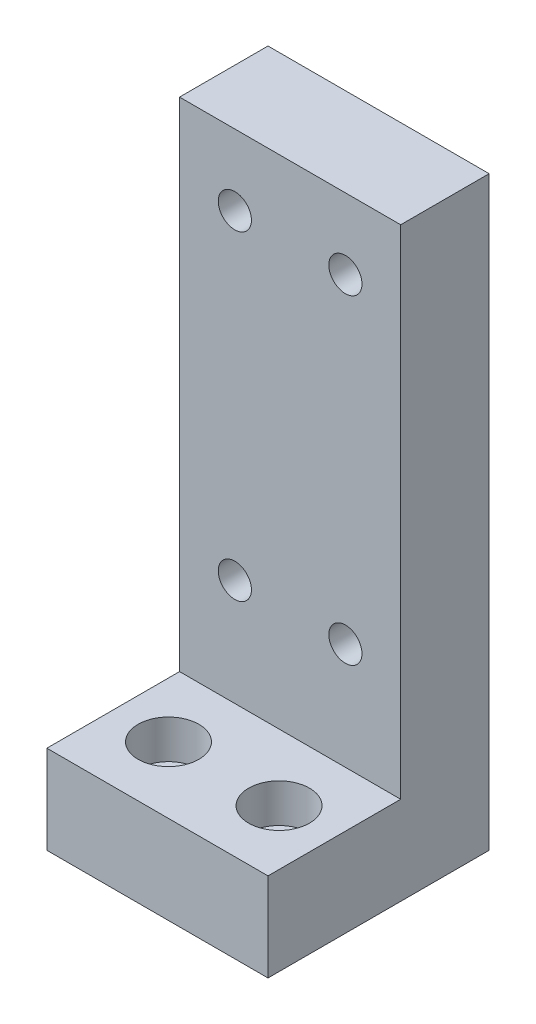
ISO-10303-21;
HEADER;
FILE_DESCRIPTION(('STEP AP214'),'2;1');
FILE_NAME('part.step','',(''),(''),'','','');
FILE_SCHEMA(('AUTOMOTIVE_DESIGN { 1 0 10303 214 1 1 1 1 }'));
ENDSEC;
DATA;
#1=APPLICATION_CONTEXT('core data for automotive mechanical design processes');
#2=APPLICATION_PROTOCOL_DEFINITION('international standard','automotive_design',2000,#1);
#3=PRODUCT_CONTEXT('',#1,'mechanical');
#4=PRODUCT('Part','Part','',(#3));
#5=PRODUCT_RELATED_PRODUCT_CATEGORY('part','',(#4));
#6=PRODUCT_DEFINITION_FORMATION('','',#4);
#7=PRODUCT_DEFINITION_CONTEXT('part definition',#1,'design');
#8=PRODUCT_DEFINITION('design','',#6,#7);
#9=PRODUCT_DEFINITION_SHAPE('','',#8);
#10=(LENGTH_UNIT() NAMED_UNIT(*) SI_UNIT(.MILLI.,.METRE.));
#11=(NAMED_UNIT(*) PLANE_ANGLE_UNIT() SI_UNIT($,.RADIAN.));
#12=(NAMED_UNIT(*) SI_UNIT($,.STERADIAN.) SOLID_ANGLE_UNIT());
#13=UNCERTAINTY_MEASURE_WITH_UNIT(LENGTH_MEASURE(1.E-05),#10,'distance_accuracy_value','');
#14=(GEOMETRIC_REPRESENTATION_CONTEXT(3) GLOBAL_UNCERTAINTY_ASSIGNED_CONTEXT((#13)) GLOBAL_UNIT_ASSIGNED_CONTEXT((#10,
#11,#12)) REPRESENTATION_CONTEXT('',''));
#15=CARTESIAN_POINT('',(0.,0.,0.));
#16=DIRECTION('',(0.,0.,1.));
#17=DIRECTION('',(1.,0.,0.));
#18=AXIS2_PLACEMENT_3D('',#15,#16,#17);
#19=CARTESIAN_POINT('',(-5.00000000000012,-12.2426406871193,14.));
#20=DIRECTION('',(0.,1.,0.));
#21=DIRECTION('',(-1.,0.,0.));
#22=AXIS2_PLACEMENT_3D('',#19,#20,#21);
#23=CYLINDRICAL_SURFACE('',#22,1.5);
#24=CARTESIAN_POINT('',(-5.00000000000012,-8.,14.));
#25=DIRECTION('',(0.,-1.,0.));
#26=DIRECTION('',(1.,0.,0.));
#27=AXIS2_PLACEMENT_3D('',#24,#25,#26);
#28=CIRCLE('',#27,1.5);
#29=CARTESIAN_POINT('',(-3.50000000000012,-8.,14.));
#30=VERTEX_POINT('',#29);
#31=EDGE_CURVE('E136',#30,#30,#28,.F.);
#32=ORIENTED_EDGE('',*,*,#31,.F.);
#33=EDGE_LOOP('',(#32));
#34=FACE_BOUND('',#33,.T.);
#35=CARTESIAN_POINT('',(-5.00000000000012,-3.5,14.));
#36=DIRECTION('',(0.,1.,0.));
#37=DIRECTION('',(-1.,0.,0.));
#38=AXIS2_PLACEMENT_3D('',#35,#36,#37);
#39=CIRCLE('',#38,1.5);
#40=CARTESIAN_POINT('',(-6.50000000000012,-3.5,14.));
#41=VERTEX_POINT('',#40);
#42=EDGE_CURVE('E37',#41,#41,#39,.F.);
#43=ORIENTED_EDGE('',*,*,#42,.F.);
#44=EDGE_LOOP('',(#43));
#45=FACE_BOUND('',#44,.T.);
#46=ADVANCED_FACE('F33',(#34,#45),#23,.F.);
#47=CARTESIAN_POINT('',(-15.0000000000004,-12.2426406871193,14.));
#48=DIRECTION('',(0.,1.,0.));
#49=DIRECTION('',(-1.,0.,0.));
#50=AXIS2_PLACEMENT_3D('',#47,#48,#49);
#51=CYLINDRICAL_SURFACE('',#50,1.5);
#52=CARTESIAN_POINT('',(-15.0000000000004,-8.,14.));
#53=DIRECTION('',(0.,-1.,0.));
#54=DIRECTION('',(1.,0.,0.));
#55=AXIS2_PLACEMENT_3D('',#52,#53,#54);
#56=CIRCLE('',#55,1.5);
#57=CARTESIAN_POINT('',(-13.5000000000004,-8.,14.));
#58=VERTEX_POINT('',#57);
#59=EDGE_CURVE('E151',#58,#58,#56,.F.);
#60=ORIENTED_EDGE('',*,*,#59,.F.);
#61=EDGE_LOOP('',(#60));
#62=FACE_BOUND('',#61,.T.);
#63=CARTESIAN_POINT('',(-15.0000000000004,-3.5,14.));
#64=DIRECTION('',(0.,1.,0.));
#65=DIRECTION('',(-1.,0.,0.));
#66=AXIS2_PLACEMENT_3D('',#63,#64,#65);
#67=CIRCLE('',#66,1.5);
#68=CARTESIAN_POINT('',(-16.5000000000004,-3.5,14.));
#69=VERTEX_POINT('',#68);
#70=EDGE_CURVE('E130',#69,#69,#67,.F.);
#71=ORIENTED_EDGE('',*,*,#70,.F.);
#72=EDGE_LOOP('',(#71));
#73=FACE_BOUND('',#72,.T.);
#74=ADVANCED_FACE('F238',(#62,#73),#51,.F.);
#75=CARTESIAN_POINT('',(-15.,38.6000000000001,-4.24264068711929));
#76=DIRECTION('',(0.,0.,1.));
#77=DIRECTION('',(1.,0.,0.));
#78=AXIS2_PLACEMENT_3D('',#75,#76,#77);
#79=CYLINDRICAL_SURFACE('',#78,1.5);
#80=CARTESIAN_POINT('',(-15.,38.6000000000001,8.));
#81=DIRECTION('',(0.,0.,1.));
#82=DIRECTION('',(1.,0.,0.));
#83=AXIS2_PLACEMENT_3D('',#80,#81,#82);
#84=CIRCLE('',#83,1.5);
#85=CARTESIAN_POINT('',(-13.5,38.6000000000001,8.));
#86=VERTEX_POINT('',#85);
#87=EDGE_CURVE('E105',#86,#86,#84,.T.);
#88=ORIENTED_EDGE('',*,*,#87,.T.);
#89=EDGE_LOOP('',(#88));
#90=FACE_BOUND('',#89,.T.);
#91=CARTESIAN_POINT('',(-15.,38.6000000000001,3.3));
#92=DIRECTION('',(0.,0.,-1.));
#93=DIRECTION('',(-1.,0.,0.));
#94=AXIS2_PLACEMENT_3D('',#91,#92,#93);
#95=CIRCLE('',#94,1.5);
#96=CARTESIAN_POINT('',(-16.5,38.6000000000001,3.3));
#97=VERTEX_POINT('',#96);
#98=EDGE_CURVE('E127',#97,#97,#95,.F.);
#99=ORIENTED_EDGE('',*,*,#98,.F.);
#100=EDGE_LOOP('',(#99));
#101=FACE_BOUND('',#100,.T.);
#102=ADVANCED_FACE('F244',(#90,#101),#79,.F.);
#103=CARTESIAN_POINT('',(-5.00000000000008,9.65000000000006,-4.24264068711929));
#104=DIRECTION('',(0.,0.,1.));
#105=DIRECTION('',(1.,0.,0.));
#106=AXIS2_PLACEMENT_3D('',#103,#104,#105);
#107=CYLINDRICAL_SURFACE('',#106,1.5);
#108=CARTESIAN_POINT('',(-5.00000000000008,9.65000000000006,8.));
#109=DIRECTION('',(0.,0.,1.));
#110=DIRECTION('',(1.,0.,0.));
#111=AXIS2_PLACEMENT_3D('',#108,#109,#110);
#112=CIRCLE('',#111,1.5);
#113=CARTESIAN_POINT('',(-3.50000000000009,9.65000000000006,8.));
#114=VERTEX_POINT('',#113);
#115=EDGE_CURVE('E129',#114,#114,#112,.T.);
#116=ORIENTED_EDGE('',*,*,#115,.T.);
#117=EDGE_LOOP('',(#116));
#118=FACE_BOUND('',#117,.T.);
#119=CARTESIAN_POINT('',(-5.00000000000008,9.65000000000006,3.3));
#120=DIRECTION('',(0.,0.,-1.));
#121=DIRECTION('',(-1.,0.,0.));
#122=AXIS2_PLACEMENT_3D('',#119,#120,#121);
#123=CIRCLE('',#122,1.5);
#124=CARTESIAN_POINT('',(-6.50000000000008,9.65000000000006,3.3));
#125=VERTEX_POINT('',#124);
#126=EDGE_CURVE('E124',#125,#125,#123,.F.);
#127=ORIENTED_EDGE('',*,*,#126,.F.);
#128=EDGE_LOOP('',(#127));
#129=FACE_BOUND('',#128,.T.);
#130=ADVANCED_FACE('F287',(#118,#129),#107,.F.);
#131=CARTESIAN_POINT('',(-15.,9.65000000000006,-4.24264068711929));
#132=DIRECTION('',(0.,0.,1.));
#133=DIRECTION('',(1.,0.,0.));
#134=AXIS2_PLACEMENT_3D('',#131,#132,#133);
#135=CYLINDRICAL_SURFACE('',#134,1.5);
#136=CARTESIAN_POINT('',(-15.,9.65000000000006,8.));
#137=DIRECTION('',(0.,0.,1.));
#138=DIRECTION('',(1.,0.,0.));
#139=AXIS2_PLACEMENT_3D('',#136,#137,#138);
#140=CIRCLE('',#139,1.5);
#141=CARTESIAN_POINT('',(-13.5,9.65000000000006,8.));
#142=VERTEX_POINT('',#141);
#143=EDGE_CURVE('E201',#142,#142,#140,.T.);
#144=ORIENTED_EDGE('',*,*,#143,.T.);
#145=EDGE_LOOP('',(#144));
#146=FACE_BOUND('',#145,.T.);
#147=CARTESIAN_POINT('',(-15.,9.65000000000006,3.3));
#148=DIRECTION('',(0.,0.,-1.));
#149=DIRECTION('',(-1.,0.,0.));
#150=AXIS2_PLACEMENT_3D('',#147,#148,#149);
#151=CIRCLE('',#150,1.5);
#152=CARTESIAN_POINT('',(-16.5,9.65000000000006,3.3));
#153=VERTEX_POINT('',#152);
#154=EDGE_CURVE('E120',#153,#153,#151,.F.);
#155=ORIENTED_EDGE('',*,*,#154,.F.);
#156=EDGE_LOOP('',(#155));
#157=FACE_BOUND('',#156,.T.);
#158=ADVANCED_FACE('F290',(#146,#157),#135,.F.);
#159=CARTESIAN_POINT('',(-5.00000000000009,38.6000000000001,-4.24264068711929));
#160=DIRECTION('',(0.,0.,1.));
#161=DIRECTION('',(1.,0.,0.));
#162=AXIS2_PLACEMENT_3D('',#159,#160,#161);
#163=CYLINDRICAL_SURFACE('',#162,1.5);
#164=CARTESIAN_POINT('',(-5.00000000000009,38.6000000000001,8.));
#165=DIRECTION('',(0.,0.,1.));
#166=DIRECTION('',(1.,0.,0.));
#167=AXIS2_PLACEMENT_3D('',#164,#165,#166);
#168=CIRCLE('',#167,1.5);
#169=CARTESIAN_POINT('',(-3.50000000000009,38.6000000000001,8.));
#170=VERTEX_POINT('',#169);
#171=EDGE_CURVE('E109',#170,#170,#168,.T.);
#172=ORIENTED_EDGE('',*,*,#171,.T.);
#173=EDGE_LOOP('',(#172));
#174=FACE_BOUND('',#173,.T.);
#175=CARTESIAN_POINT('',(-5.00000000000009,38.6000000000001,3.3));
#176=DIRECTION('',(0.,0.,-1.));
#177=DIRECTION('',(-1.,0.,0.));
#178=AXIS2_PLACEMENT_3D('',#175,#176,#177);
#179=CIRCLE('',#178,1.5);
#180=CARTESIAN_POINT('',(-6.50000000000009,38.6000000000001,3.3));
#181=VERTEX_POINT('',#180);
#182=EDGE_CURVE('E117',#181,#181,#179,.F.);
#183=ORIENTED_EDGE('',*,*,#182,.F.);
#184=EDGE_LOOP('',(#183));
#185=FACE_BOUND('',#184,.T.);
#186=ADVANCED_FACE('F292',(#174,#185),#163,.F.);
#187=CARTESIAN_POINT('',(0.,0.,8.));
#188=DIRECTION('',(-1.,0.,0.));
#189=DIRECTION('',(0.,-1.,0.));
#190=AXIS2_PLACEMENT_3D('',#187,#188,#189);
#191=PLANE('',#190);
#192=DIRECTION('',(0.,1.,0.));
#193=VECTOR('',#192,1.);
#194=CARTESIAN_POINT('',(0.,0.,0.));
#195=LINE('',#194,#193);
#196=CARTESIAN_POINT('',(0.,-8.,0.));
#197=VERTEX_POINT('',#196);
#198=CARTESIAN_POINT('',(0.,45.,0.));
#199=VERTEX_POINT('',#198);
#200=EDGE_CURVE('E98',#197,#199,#195,.T.);
#201=ORIENTED_EDGE('',*,*,#200,.T.);
#202=DIRECTION('',(0.,0.,-1.));
#203=VECTOR('',#202,1.);
#204=CARTESIAN_POINT('',(0.,45.,8.));
#205=LINE('',#204,#203);
#206=CARTESIAN_POINT('',(0.,45.,8.));
#207=VERTEX_POINT('',#206);
#208=EDGE_CURVE('E11',#207,#199,#205,.T.);
#209=ORIENTED_EDGE('',*,*,#208,.F.);
#210=DIRECTION('',(0.,1.,0.));
#211=VECTOR('',#210,1.);
#212=CARTESIAN_POINT('',(0.,0.,8.));
#213=LINE('',#212,#211);
#214=CARTESIAN_POINT('',(0.,0.,8.));
#215=VERTEX_POINT('',#214);
#216=EDGE_CURVE('E90',#215,#207,#213,.T.);
#217=ORIENTED_EDGE('',*,*,#216,.F.);
#218=DIRECTION('',(0.,0.,1.));
#219=VECTOR('',#218,1.);
#220=CARTESIAN_POINT('',(0.,0.,0.));
#221=LINE('',#220,#219);
#222=CARTESIAN_POINT('',(-2.42861286636753E-13,0.,20.));
#223=VERTEX_POINT('',#222);
#224=EDGE_CURVE('E52',#215,#223,#221,.T.);
#225=ORIENTED_EDGE('',*,*,#224,.T.);
#226=DIRECTION('',(0.,1.,0.));
#227=VECTOR('',#226,1.);
#228=CARTESIAN_POINT('',(-2.42126498557265E-13,-8.,20.));
#229=LINE('',#228,#227);
#230=CARTESIAN_POINT('',(-2.42126498557265E-13,-8.,20.));
#231=VERTEX_POINT('',#230);
#232=EDGE_CURVE('E173',#231,#223,#229,.T.);
#233=ORIENTED_EDGE('',*,*,#232,.F.);
#234=DIRECTION('',(0.,0.,1.));
#235=VECTOR('',#234,1.);
#236=CARTESIAN_POINT('',(0.,-8.,0.));
#237=LINE('',#236,#235);
#238=EDGE_CURVE('E102',#197,#231,#237,.T.);
#239=ORIENTED_EDGE('',*,*,#238,.F.);
#240=EDGE_LOOP('',(#201,#209,#217,#225,#233,#239));
#241=FACE_BOUND('',#240,.T.);
#242=ADVANCED_FACE('F35',(#241),#191,.F.);
#243=CARTESIAN_POINT('',(0.,45.,8.));
#244=DIRECTION('',(0.,-1.,0.));
#245=DIRECTION('',(1.,0.,0.));
#246=AXIS2_PLACEMENT_3D('',#243,#244,#245);
#247=PLANE('',#246);
#248=DIRECTION('',(-1.,0.,0.));
#249=VECTOR('',#248,1.);
#250=CARTESIAN_POINT('',(0.,45.,0.));
#251=LINE('',#250,#249);
#252=CARTESIAN_POINT('',(-20.,45.,0.));
#253=VERTEX_POINT('',#252);
#254=EDGE_CURVE('E65',#199,#253,#251,.T.);
#255=ORIENTED_EDGE('',*,*,#254,.T.);
#256=DIRECTION('',(0.,0.,-1.));
#257=VECTOR('',#256,1.);
#258=CARTESIAN_POINT('',(-20.,45.,8.));
#259=LINE('',#258,#257);
#260=CARTESIAN_POINT('',(-20.,45.,8.));
#261=VERTEX_POINT('',#260);
#262=EDGE_CURVE('E43',#261,#253,#259,.T.);
#263=ORIENTED_EDGE('',*,*,#262,.F.);
#264=DIRECTION('',(-1.,0.,0.));
#265=VECTOR('',#264,1.);
#266=CARTESIAN_POINT('',(0.,45.,8.));
#267=LINE('',#266,#265);
#268=EDGE_CURVE('E80',#207,#261,#267,.T.);
#269=ORIENTED_EDGE('',*,*,#268,.F.);
#270=ORIENTED_EDGE('',*,*,#208,.T.);
#271=EDGE_LOOP('',(#255,#263,#269,#270));
#272=FACE_BOUND('',#271,.T.);
#273=ADVANCED_FACE('F82',(#272),#247,.F.);
#274=CARTESIAN_POINT('',(-20.,0.,8.));
#275=DIRECTION('',(1.,0.,0.));
#276=DIRECTION('',(0.,0.,-1.));
#277=AXIS2_PLACEMENT_3D('',#274,#275,#276);
#278=PLANE('',#277);
#279=DIRECTION('',(0.,-1.,0.));
#280=VECTOR('',#279,1.);
#281=CARTESIAN_POINT('',(-20.,0.,0.));
#282=LINE('',#281,#280);
#283=CARTESIAN_POINT('',(-20.,-8.,0.));
#284=VERTEX_POINT('',#283);
#285=EDGE_CURVE('E95',#253,#284,#282,.T.);
#286=ORIENTED_EDGE('',*,*,#285,.T.);
#287=DIRECTION('',(0.,0.,-1.));
#288=VECTOR('',#287,1.);
#289=CARTESIAN_POINT('',(-20.0000000000002,-8.,20.));
#290=LINE('',#289,#288);
#291=CARTESIAN_POINT('',(-20.0000000000002,-8.,20.));
#292=VERTEX_POINT('',#291);
#293=EDGE_CURVE('E157',#292,#284,#290,.T.);
#294=ORIENTED_EDGE('',*,*,#293,.F.);
#295=DIRECTION('',(0.,1.,0.));
#296=VECTOR('',#295,1.);
#297=CARTESIAN_POINT('',(-20.0000000000002,-8.,20.));
#298=LINE('',#297,#296);
#299=CARTESIAN_POINT('',(-20.0000000000002,0.,20.));
#300=VERTEX_POINT('',#299);
#301=EDGE_CURVE('E166',#292,#300,#298,.T.);
#302=ORIENTED_EDGE('',*,*,#301,.T.);
#303=DIRECTION('',(0.,0.,-1.));
#304=VECTOR('',#303,1.);
#305=CARTESIAN_POINT('',(-20.0000000000002,0.,20.));
#306=LINE('',#305,#304);
#307=CARTESIAN_POINT('',(-20.0000000000001,0.,8.));
#308=VERTEX_POINT('',#307);
#309=EDGE_CURVE('E154',#300,#308,#306,.T.);
#310=ORIENTED_EDGE('',*,*,#309,.T.);
#311=DIRECTION('',(0.,-1.,0.));
#312=VECTOR('',#311,1.);
#313=CARTESIAN_POINT('',(-20.,0.,8.));
#314=LINE('',#313,#312);
#315=EDGE_CURVE('E89',#261,#308,#314,.T.);
#316=ORIENTED_EDGE('',*,*,#315,.F.);
#317=ORIENTED_EDGE('',*,*,#262,.T.);
#318=EDGE_LOOP('',(#286,#294,#302,#310,#316,#317));
#319=FACE_BOUND('',#318,.T.);
#320=ADVANCED_FACE('F206',(#319),#278,.F.);
#321=CARTESIAN_POINT('',(0.,0.,8.));
#322=DIRECTION('',(0.,0.,1.));
#323=DIRECTION('',(1.,0.,0.));
#324=AXIS2_PLACEMENT_3D('',#321,#322,#323);
#325=PLANE('',#324);
#326=ORIENTED_EDGE('',*,*,#171,.F.);
#327=EDGE_LOOP('',(#326));
#328=FACE_BOUND('',#327,.T.);
#329=ORIENTED_EDGE('',*,*,#143,.F.);
#330=EDGE_LOOP('',(#329));
#331=FACE_BOUND('',#330,.T.);
#332=ORIENTED_EDGE('',*,*,#115,.F.);
#333=EDGE_LOOP('',(#332));
#334=FACE_BOUND('',#333,.T.);
#335=ORIENTED_EDGE('',*,*,#87,.F.);
#336=EDGE_LOOP('',(#335));
#337=FACE_BOUND('',#336,.T.);
#338=ORIENTED_EDGE('',*,*,#216,.T.);
#339=ORIENTED_EDGE('',*,*,#268,.T.);
#340=ORIENTED_EDGE('',*,*,#315,.T.);
#341=DIRECTION('',(1.,0.,0.));
#342=VECTOR('',#341,1.);
#343=CARTESIAN_POINT('',(0.,0.,8.));
#344=LINE('',#343,#342);
#345=EDGE_CURVE('E69',#308,#215,#344,.T.);
#346=ORIENTED_EDGE('',*,*,#345,.T.);
#347=EDGE_LOOP('',(#338,#339,#340,#346));
#348=FACE_BOUND('',#347,.T.);
#349=ADVANCED_FACE('F93',(#328,#331,#334,#337,#348),#325,.T.);
#350=CARTESIAN_POINT('',(0.,0.,0.));
#351=DIRECTION('',(0.,0.,1.));
#352=DIRECTION('',(1.,0.,0.));
#353=AXIS2_PLACEMENT_3D('',#350,#351,#352);
#354=PLANE('',#353);
#355=CARTESIAN_POINT('',(-15.,38.6000000000001,0.));
#356=DIRECTION('',(0.,0.,-1.));
#357=DIRECTION('',(-1.,0.,0.));
#358=AXIS2_PLACEMENT_3D('',#355,#356,#357);
#359=CIRCLE('',#358,2.75);
#360=CARTESIAN_POINT('',(-17.75,38.6000000000001,0.));
#361=VERTEX_POINT('',#360);
#362=EDGE_CURVE('E187',#361,#361,#359,.T.);
#363=ORIENTED_EDGE('',*,*,#362,.F.);
#364=EDGE_LOOP('',(#363));
#365=FACE_BOUND('',#364,.T.);
#366=CARTESIAN_POINT('',(-5.00000000000008,9.65000000000006,0.));
#367=DIRECTION('',(0.,0.,-1.));
#368=DIRECTION('',(-1.,0.,0.));
#369=AXIS2_PLACEMENT_3D('',#366,#367,#368);
#370=CIRCLE('',#369,2.75);
#371=CARTESIAN_POINT('',(-7.75000000000008,9.65000000000006,0.));
#372=VERTEX_POINT('',#371);
#373=EDGE_CURVE('E180',#372,#372,#370,.T.);
#374=ORIENTED_EDGE('',*,*,#373,.F.);
#375=EDGE_LOOP('',(#374));
#376=FACE_BOUND('',#375,.T.);
#377=CARTESIAN_POINT('',(-15.,9.65000000000006,0.));
#378=DIRECTION('',(0.,0.,-1.));
#379=DIRECTION('',(-1.,0.,0.));
#380=AXIS2_PLACEMENT_3D('',#377,#378,#379);
#381=CIRCLE('',#380,2.75);
#382=CARTESIAN_POINT('',(-17.75,9.65000000000006,0.));
#383=VERTEX_POINT('',#382);
#384=EDGE_CURVE('E176',#383,#383,#381,.T.);
#385=ORIENTED_EDGE('',*,*,#384,.F.);
#386=EDGE_LOOP('',(#385));
#387=FACE_BOUND('',#386,.T.);
#388=CARTESIAN_POINT('',(-5.00000000000009,38.6000000000001,0.));
#389=DIRECTION('',(0.,0.,-1.));
#390=DIRECTION('',(-1.,0.,0.));
#391=AXIS2_PLACEMENT_3D('',#388,#389,#390);
#392=CIRCLE('',#391,2.75);
#393=CARTESIAN_POINT('',(-7.75000000000009,38.6000000000001,0.));
#394=VERTEX_POINT('',#393);
#395=EDGE_CURVE('E186',#394,#394,#392,.T.);
#396=ORIENTED_EDGE('',*,*,#395,.F.);
#397=EDGE_LOOP('',(#396));
#398=FACE_BOUND('',#397,.T.);
#399=ORIENTED_EDGE('',*,*,#200,.F.);
#400=DIRECTION('',(1.,0.,0.));
#401=VECTOR('',#400,1.);
#402=CARTESIAN_POINT('',(-20.,-8.,0.));
#403=LINE('',#402,#401);
#404=EDGE_CURVE('E160',#284,#197,#403,.T.);
#405=ORIENTED_EDGE('',*,*,#404,.F.);
#406=ORIENTED_EDGE('',*,*,#285,.F.);
#407=ORIENTED_EDGE('',*,*,#254,.F.);
#408=EDGE_LOOP('',(#399,#405,#406,#407));
#409=FACE_BOUND('',#408,.T.);
#410=ADVANCED_FACE('F220',(#365,#376,#387,#398,#409),#354,.F.);
#411=CARTESIAN_POINT('',(-5.00000000000009,38.6000000000001,3.3));
#412=DIRECTION('',(0.,0.,-1.));
#413=DIRECTION('',(-1.,0.,0.));
#414=AXIS2_PLACEMENT_3D('',#411,#412,#413);
#415=PLANE('',#414);
#416=CARTESIAN_POINT('',(-5.00000000000009,38.6000000000001,3.3));
#417=DIRECTION('',(0.,0.,-1.));
#418=DIRECTION('',(-1.,0.,0.));
#419=AXIS2_PLACEMENT_3D('',#416,#417,#418);
#420=CIRCLE('',#419,2.75);
#421=CARTESIAN_POINT('',(-7.75000000000009,38.6000000000001,3.3));
#422=VERTEX_POINT('',#421);
#423=EDGE_CURVE('E121',#422,#422,#420,.T.);
#424=ORIENTED_EDGE('',*,*,#423,.T.);
#425=EDGE_LOOP('',(#424));
#426=FACE_BOUND('',#425,.T.);
#427=ORIENTED_EDGE('',*,*,#182,.T.);
#428=EDGE_LOOP('',(#427));
#429=FACE_BOUND('',#428,.T.);
#430=ADVANCED_FACE('F222',(#426,#429),#415,.T.);
#431=CARTESIAN_POINT('',(-5.00000000000009,38.6000000000001,3.3));
#432=DIRECTION('',(0.,0.,-1.));
#433=DIRECTION('',(-1.,0.,0.));
#434=AXIS2_PLACEMENT_3D('',#431,#432,#433);
#435=CYLINDRICAL_SURFACE('',#434,2.75);
#436=ORIENTED_EDGE('',*,*,#423,.F.);
#437=EDGE_LOOP('',(#436));
#438=FACE_BOUND('',#437,.T.);
#439=ORIENTED_EDGE('',*,*,#395,.T.);
#440=EDGE_LOOP('',(#439));
#441=FACE_BOUND('',#440,.T.);
#442=ADVANCED_FACE('F229',(#438,#441),#435,.F.);
#443=CARTESIAN_POINT('',(-15.,9.65000000000006,3.3));
#444=DIRECTION('',(0.,0.,-1.));
#445=DIRECTION('',(-1.,0.,0.));
#446=AXIS2_PLACEMENT_3D('',#443,#444,#445);
#447=PLANE('',#446);
#448=CARTESIAN_POINT('',(-15.,9.65000000000006,3.3));
#449=DIRECTION('',(0.,0.,-1.));
#450=DIRECTION('',(-1.,0.,0.));
#451=AXIS2_PLACEMENT_3D('',#448,#449,#450);
#452=CIRCLE('',#451,2.75);
#453=CARTESIAN_POINT('',(-17.75,9.65000000000006,3.3));
#454=VERTEX_POINT('',#453);
#455=EDGE_CURVE('E177',#454,#454,#452,.T.);
#456=ORIENTED_EDGE('',*,*,#455,.T.);
#457=EDGE_LOOP('',(#456));
#458=FACE_BOUND('',#457,.T.);
#459=ORIENTED_EDGE('',*,*,#154,.T.);
#460=EDGE_LOOP('',(#459));
#461=FACE_BOUND('',#460,.T.);
#462=ADVANCED_FACE('F261',(#458,#461),#447,.T.);
#463=CARTESIAN_POINT('',(-15.,9.65000000000006,3.3));
#464=DIRECTION('',(0.,0.,-1.));
#465=DIRECTION('',(-1.,0.,0.));
#466=AXIS2_PLACEMENT_3D('',#463,#464,#465);
#467=CYLINDRICAL_SURFACE('',#466,2.75);
#468=ORIENTED_EDGE('',*,*,#455,.F.);
#469=EDGE_LOOP('',(#468));
#470=FACE_BOUND('',#469,.T.);
#471=ORIENTED_EDGE('',*,*,#384,.T.);
#472=EDGE_LOOP('',(#471));
#473=FACE_BOUND('',#472,.T.);
#474=ADVANCED_FACE('F264',(#470,#473),#467,.F.);
#475=CARTESIAN_POINT('',(-5.00000000000008,9.65000000000006,3.3));
#476=DIRECTION('',(0.,0.,-1.));
#477=DIRECTION('',(-1.,0.,0.));
#478=AXIS2_PLACEMENT_3D('',#475,#476,#477);
#479=PLANE('',#478);
#480=CARTESIAN_POINT('',(-5.00000000000008,9.65000000000006,3.3));
#481=DIRECTION('',(0.,0.,-1.));
#482=DIRECTION('',(-1.,0.,0.));
#483=AXIS2_PLACEMENT_3D('',#480,#481,#482);
#484=CIRCLE('',#483,2.75);
#485=CARTESIAN_POINT('',(-7.75000000000008,9.65000000000006,3.3));
#486=VERTEX_POINT('',#485);
#487=EDGE_CURVE('E190',#486,#486,#484,.T.);
#488=ORIENTED_EDGE('',*,*,#487,.T.);
#489=EDGE_LOOP('',(#488));
#490=FACE_BOUND('',#489,.T.);
#491=ORIENTED_EDGE('',*,*,#126,.T.);
#492=EDGE_LOOP('',(#491));
#493=FACE_BOUND('',#492,.T.);
#494=ADVANCED_FACE('F268',(#490,#493),#479,.T.);
#495=CARTESIAN_POINT('',(-5.00000000000008,9.65000000000006,3.3));
#496=DIRECTION('',(0.,0.,-1.));
#497=DIRECTION('',(-1.,0.,0.));
#498=AXIS2_PLACEMENT_3D('',#495,#496,#497);
#499=CYLINDRICAL_SURFACE('',#498,2.75);
#500=ORIENTED_EDGE('',*,*,#487,.F.);
#501=EDGE_LOOP('',(#500));
#502=FACE_BOUND('',#501,.T.);
#503=ORIENTED_EDGE('',*,*,#373,.T.);
#504=EDGE_LOOP('',(#503));
#505=FACE_BOUND('',#504,.T.);
#506=ADVANCED_FACE('F273',(#502,#505),#499,.F.);
#507=CARTESIAN_POINT('',(-15.,38.6000000000001,3.3));
#508=DIRECTION('',(0.,0.,-1.));
#509=DIRECTION('',(-1.,0.,0.));
#510=AXIS2_PLACEMENT_3D('',#507,#508,#509);
#511=PLANE('',#510);
#512=CARTESIAN_POINT('',(-15.,38.6000000000001,3.3));
#513=DIRECTION('',(0.,0.,-1.));
#514=DIRECTION('',(-1.,0.,0.));
#515=AXIS2_PLACEMENT_3D('',#512,#513,#514);
#516=CIRCLE('',#515,2.75);
#517=CARTESIAN_POINT('',(-17.75,38.6000000000001,3.3));
#518=VERTEX_POINT('',#517);
#519=EDGE_CURVE('E183',#518,#518,#516,.T.);
#520=ORIENTED_EDGE('',*,*,#519,.T.);
#521=EDGE_LOOP('',(#520));
#522=FACE_BOUND('',#521,.T.);
#523=ORIENTED_EDGE('',*,*,#98,.T.);
#524=EDGE_LOOP('',(#523));
#525=FACE_BOUND('',#524,.T.);
#526=ADVANCED_FACE('F270',(#522,#525),#511,.T.);
#527=CARTESIAN_POINT('',(-15.,38.6000000000001,3.3));
#528=DIRECTION('',(0.,0.,-1.));
#529=DIRECTION('',(-1.,0.,0.));
#530=AXIS2_PLACEMENT_3D('',#527,#528,#529);
#531=CYLINDRICAL_SURFACE('',#530,2.75);
#532=ORIENTED_EDGE('',*,*,#519,.F.);
#533=EDGE_LOOP('',(#532));
#534=FACE_BOUND('',#533,.T.);
#535=ORIENTED_EDGE('',*,*,#362,.T.);
#536=EDGE_LOOP('',(#535));
#537=FACE_BOUND('',#536,.T.);
#538=ADVANCED_FACE('F260',(#534,#537),#531,.F.);
#539=CARTESIAN_POINT('',(-2.42126498557265E-13,-8.,20.));
#540=DIRECTION('',(0.,0.,-1.));
#541=DIRECTION('',(-1.,0.,0.));
#542=AXIS2_PLACEMENT_3D('',#539,#540,#541);
#543=PLANE('',#542);
#544=DIRECTION('',(-1.,0.,0.));
#545=VECTOR('',#544,1.);
#546=CARTESIAN_POINT('',(-2.42861286636753E-13,0.,20.));
#547=LINE('',#546,#545);
#548=EDGE_CURVE('E161',#223,#300,#547,.T.);
#549=ORIENTED_EDGE('',*,*,#548,.T.);
#550=ORIENTED_EDGE('',*,*,#301,.F.);
#551=DIRECTION('',(-1.,0.,0.));
#552=VECTOR('',#551,1.);
#553=CARTESIAN_POINT('',(-2.42126498557265E-13,-8.,20.));
#554=LINE('',#553,#552);
#555=EDGE_CURVE('E164',#231,#292,#554,.T.);
#556=ORIENTED_EDGE('',*,*,#555,.F.);
#557=ORIENTED_EDGE('',*,*,#232,.T.);
#558=EDGE_LOOP('',(#549,#550,#556,#557));
#559=FACE_BOUND('',#558,.T.);
#560=ADVANCED_FACE('F219',(#559),#543,.F.);
#561=CARTESIAN_POINT('',(0.,-8.,0.));
#562=DIRECTION('',(0.,-1.,0.));
#563=DIRECTION('',(1.,0.,0.));
#564=AXIS2_PLACEMENT_3D('',#561,#562,#563);
#565=PLANE('',#564);
#566=ORIENTED_EDGE('',*,*,#59,.T.);
#567=EDGE_LOOP('',(#566));
#568=FACE_BOUND('',#567,.T.);
#569=ORIENTED_EDGE('',*,*,#31,.T.);
#570=EDGE_LOOP('',(#569));
#571=FACE_BOUND('',#570,.T.);
#572=ORIENTED_EDGE('',*,*,#293,.T.);
#573=ORIENTED_EDGE('',*,*,#404,.T.);
#574=ORIENTED_EDGE('',*,*,#238,.T.);
#575=ORIENTED_EDGE('',*,*,#555,.T.);
#576=EDGE_LOOP('',(#572,#573,#574,#575));
#577=FACE_BOUND('',#576,.T.);
#578=ADVANCED_FACE('F217',(#568,#571,#577),#565,.T.);
#579=CARTESIAN_POINT('',(0.,0.,0.));
#580=DIRECTION('',(0.,-1.,0.));
#581=DIRECTION('',(1.,0.,0.));
#582=AXIS2_PLACEMENT_3D('',#579,#580,#581);
#583=PLANE('',#582);
#584=CARTESIAN_POINT('',(-15.0000000000004,0.,14.));
#585=DIRECTION('',(0.,1.,0.));
#586=DIRECTION('',(-1.,0.,0.));
#587=AXIS2_PLACEMENT_3D('',#584,#585,#586);
#588=CIRCLE('',#587,2.75);
#589=CARTESIAN_POINT('',(-17.7500000000004,0.,14.));
#590=VERTEX_POINT('',#589);
#591=EDGE_CURVE('E138',#590,#590,#588,.T.);
#592=ORIENTED_EDGE('',*,*,#591,.F.);
#593=EDGE_LOOP('',(#592));
#594=FACE_BOUND('',#593,.T.);
#595=CARTESIAN_POINT('',(-5.00000000000012,0.,14.));
#596=DIRECTION('',(0.,1.,0.));
#597=DIRECTION('',(-1.,0.,0.));
#598=AXIS2_PLACEMENT_3D('',#595,#596,#597);
#599=CIRCLE('',#598,2.75);
#600=CARTESIAN_POINT('',(-7.75000000000012,0.,14.));
#601=VERTEX_POINT('',#600);
#602=EDGE_CURVE('E148',#601,#601,#599,.T.);
#603=ORIENTED_EDGE('',*,*,#602,.F.);
#604=EDGE_LOOP('',(#603));
#605=FACE_BOUND('',#604,.T.);
#606=ORIENTED_EDGE('',*,*,#345,.F.);
#607=ORIENTED_EDGE('',*,*,#309,.F.);
#608=ORIENTED_EDGE('',*,*,#548,.F.);
#609=ORIENTED_EDGE('',*,*,#224,.F.);
#610=EDGE_LOOP('',(#606,#607,#608,#609));
#611=FACE_BOUND('',#610,.T.);
#612=ADVANCED_FACE('F209',(#594,#605,#611),#583,.F.);
#613=CARTESIAN_POINT('',(-15.0000000000004,-3.5,14.));
#614=DIRECTION('',(0.,1.,0.));
#615=DIRECTION('',(-1.,0.,0.));
#616=AXIS2_PLACEMENT_3D('',#613,#614,#615);
#617=PLANE('',#616);
#618=CARTESIAN_POINT('',(-15.0000000000004,-3.5,14.));
#619=DIRECTION('',(0.,1.,0.));
#620=DIRECTION('',(-1.,0.,0.));
#621=AXIS2_PLACEMENT_3D('',#618,#619,#620);
#622=CIRCLE('',#621,2.75);
#623=CARTESIAN_POINT('',(-17.7500000000004,-3.5,14.));
#624=VERTEX_POINT('',#623);
#625=EDGE_CURVE('E132',#624,#624,#622,.T.);
#626=ORIENTED_EDGE('',*,*,#625,.T.);
#627=EDGE_LOOP('',(#626));
#628=FACE_BOUND('',#627,.T.);
#629=ORIENTED_EDGE('',*,*,#70,.T.);
#630=EDGE_LOOP('',(#629));
#631=FACE_BOUND('',#630,.T.);
#632=ADVANCED_FACE('F256',(#628,#631),#617,.T.);
#633=CARTESIAN_POINT('',(-15.0000000000004,-3.5,14.));
#634=DIRECTION('',(0.,1.,0.));
#635=DIRECTION('',(-1.,0.,0.));
#636=AXIS2_PLACEMENT_3D('',#633,#634,#635);
#637=CYLINDRICAL_SURFACE('',#636,2.75);
#638=ORIENTED_EDGE('',*,*,#625,.F.);
#639=EDGE_LOOP('',(#638));
#640=FACE_BOUND('',#639,.T.);
#641=ORIENTED_EDGE('',*,*,#591,.T.);
#642=EDGE_LOOP('',(#641));
#643=FACE_BOUND('',#642,.T.);
#644=ADVANCED_FACE('F384',(#640,#643),#637,.F.);
#645=CARTESIAN_POINT('',(-5.00000000000012,-3.5,14.));
#646=DIRECTION('',(0.,1.,0.));
#647=DIRECTION('',(-1.,0.,0.));
#648=AXIS2_PLACEMENT_3D('',#645,#646,#647);
#649=PLANE('',#648);
#650=CARTESIAN_POINT('',(-5.00000000000012,-3.5,14.));
#651=DIRECTION('',(0.,1.,0.));
#652=DIRECTION('',(-1.,0.,0.));
#653=AXIS2_PLACEMENT_3D('',#650,#651,#652);
#654=CIRCLE('',#653,2.75);
#655=CARTESIAN_POINT('',(-7.75000000000012,-3.5,14.));
#656=VERTEX_POINT('',#655);
#657=EDGE_CURVE('E143',#656,#656,#654,.T.);
#658=ORIENTED_EDGE('',*,*,#657,.T.);
#659=EDGE_LOOP('',(#658));
#660=FACE_BOUND('',#659,.T.);
#661=ORIENTED_EDGE('',*,*,#42,.T.);
#662=EDGE_LOOP('',(#661));
#663=FACE_BOUND('',#662,.T.);
#664=ADVANCED_FACE('F393',(#660,#663),#649,.T.);
#665=CARTESIAN_POINT('',(-5.00000000000012,-3.5,14.));
#666=DIRECTION('',(0.,1.,0.));
#667=DIRECTION('',(-1.,0.,0.));
#668=AXIS2_PLACEMENT_3D('',#665,#666,#667);
#669=CYLINDRICAL_SURFACE('',#668,2.75);
#670=ORIENTED_EDGE('',*,*,#657,.F.);
#671=EDGE_LOOP('',(#670));
#672=FACE_BOUND('',#671,.T.);
#673=ORIENTED_EDGE('',*,*,#602,.T.);
#674=EDGE_LOOP('',(#673));
#675=FACE_BOUND('',#674,.T.);
#676=ADVANCED_FACE('F403',(#672,#675),#669,.F.);
#677=CLOSED_SHELL('',(#46,#74,#102,#130,#158,#186,#242,#273,#320,#349,#410,#430,#442,#462,#474,
#494,#506,#526,#538,#560,#578,#612,#632,#644,#664,#676));
#678=MANIFOLD_SOLID_BREP('B2',#677);
#679=ADVANCED_BREP_SHAPE_REPRESENTATION('',(#18,#678),#14);
#680=SHAPE_DEFINITION_REPRESENTATION(#9,#679);
ENDSEC;
END-ISO-10303-21;
